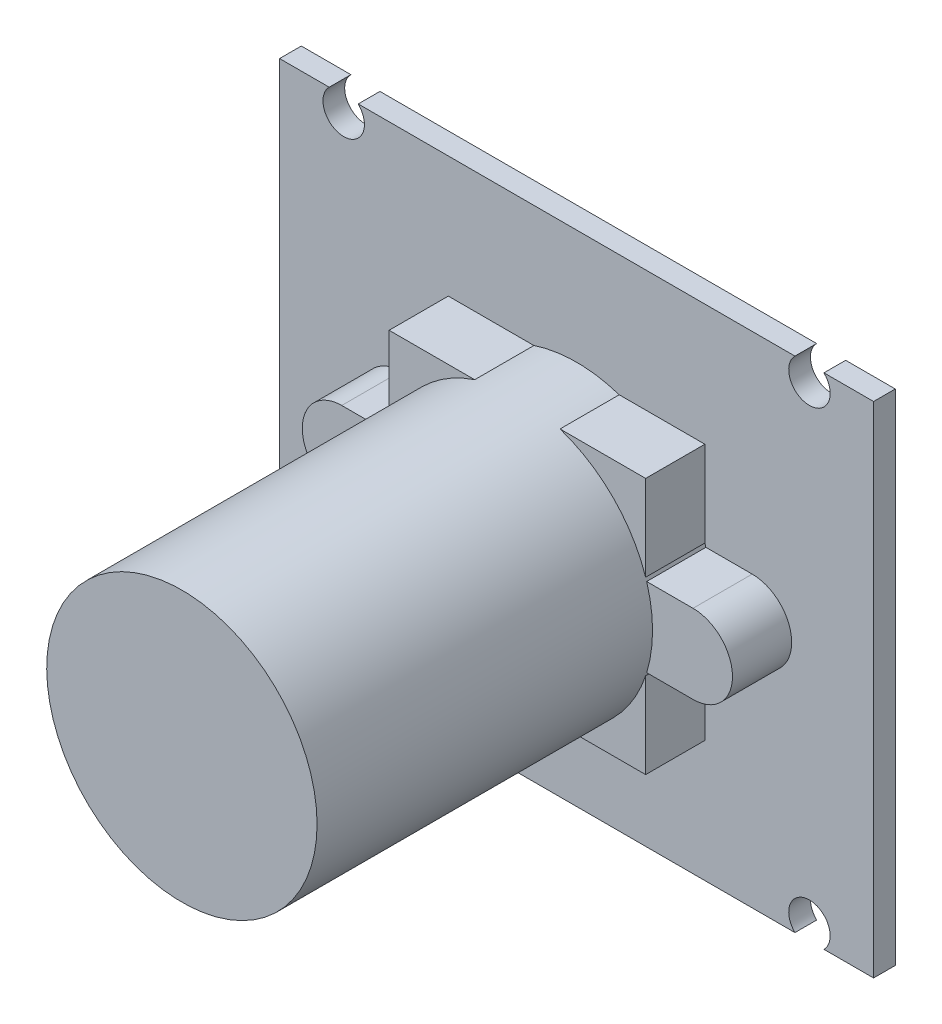
ISO-10303-21;
HEADER;
FILE_DESCRIPTION(('STEP AP214'),'2;1');
FILE_NAME('part.step','',(''),(''),'','','');
FILE_SCHEMA(('AUTOMOTIVE_DESIGN { 1 0 10303 214 1 1 1 1 }'));
ENDSEC;
DATA;
#1=APPLICATION_CONTEXT('core data for automotive mechanical design processes');
#2=APPLICATION_PROTOCOL_DEFINITION('international standard','automotive_design',2000,#1);
#3=PRODUCT_CONTEXT('',#1,'mechanical');
#4=PRODUCT('Part','Part','',(#3));
#5=PRODUCT_RELATED_PRODUCT_CATEGORY('part','',(#4));
#6=PRODUCT_DEFINITION_FORMATION('','',#4);
#7=PRODUCT_DEFINITION_CONTEXT('part definition',#1,'design');
#8=PRODUCT_DEFINITION('design','',#6,#7);
#9=PRODUCT_DEFINITION_SHAPE('','',#8);
#10=(LENGTH_UNIT() NAMED_UNIT(*) SI_UNIT(.MILLI.,.METRE.));
#11=(NAMED_UNIT(*) PLANE_ANGLE_UNIT() SI_UNIT($,.RADIAN.));
#12=(NAMED_UNIT(*) SI_UNIT($,.STERADIAN.) SOLID_ANGLE_UNIT());
#13=UNCERTAINTY_MEASURE_WITH_UNIT(LENGTH_MEASURE(1.E-05),#10,'distance_accuracy_value','');
#14=(GEOMETRIC_REPRESENTATION_CONTEXT(3) GLOBAL_UNCERTAINTY_ASSIGNED_CONTEXT((#13)) GLOBAL_UNIT_ASSIGNED_CONTEXT((#10,
#11,#12)) REPRESENTATION_CONTEXT('',''));
#15=CARTESIAN_POINT('',(0.,0.,0.));
#16=DIRECTION('',(0.,0.,1.));
#17=DIRECTION('',(1.,0.,0.));
#18=AXIS2_PLACEMENT_3D('',#15,#16,#17);
#19=CARTESIAN_POINT('',(0.,0.,1.1));
#20=DIRECTION('',(0.,0.,-1.));
#21=DIRECTION('',(-1.,0.,0.));
#22=AXIS2_PLACEMENT_3D('',#19,#20,#21);
#23=PLANE('',#22);
#24=DIRECTION('',(1.,0.,0.));
#25=VECTOR('',#24,1.);
#26=CARTESIAN_POINT('',(-15.05,-12.65,1.1));
#27=LINE('',#26,#25);
#28=CARTESIAN_POINT('',(-15.05,-12.65,1.1));
#29=VERTEX_POINT('',#28);
#30=CARTESIAN_POINT('',(-12.534846922835,-12.65,1.1));
#31=VERTEX_POINT('',#30);
#32=EDGE_CURVE('E433',#29,#31,#27,.T.);
#33=ORIENTED_EDGE('',*,*,#32,.T.);
#34=CARTESIAN_POINT('',(-11.8,-11.9,1.1));
#35=DIRECTION('',(0.,0.,1.));
#36=DIRECTION('',(1.,0.,0.));
#37=AXIS2_PLACEMENT_3D('',#34,#35,#36);
#38=CIRCLE('',#37,1.05);
#39=CARTESIAN_POINT('',(-11.065153077165,-12.65,1.1));
#40=VERTEX_POINT('',#39);
#41=EDGE_CURVE('E386',#40,#31,#38,.T.);
#42=ORIENTED_EDGE('',*,*,#41,.F.);
#43=CARTESIAN_POINT('',(11.065153077165,-12.65,1.1));
#44=VERTEX_POINT('',#43);
#45=EDGE_CURVE('E437',#40,#44,#27,.T.);
#46=ORIENTED_EDGE('',*,*,#45,.T.);
#47=CARTESIAN_POINT('',(11.8,-11.9,1.1));
#48=DIRECTION('',(0.,0.,1.));
#49=DIRECTION('',(1.,0.,0.));
#50=AXIS2_PLACEMENT_3D('',#47,#48,#49);
#51=CIRCLE('',#50,1.05);
#52=CARTESIAN_POINT('',(12.534846922835,-12.65,1.1));
#53=VERTEX_POINT('',#52);
#54=EDGE_CURVE('E394',#53,#44,#51,.T.);
#55=ORIENTED_EDGE('',*,*,#54,.F.);
#56=CARTESIAN_POINT('',(15.05,-12.65,1.1));
#57=VERTEX_POINT('',#56);
#58=EDGE_CURVE('E432',#53,#57,#27,.T.);
#59=ORIENTED_EDGE('',*,*,#58,.T.);
#60=DIRECTION('',(0.,1.,0.));
#61=VECTOR('',#60,1.);
#62=CARTESIAN_POINT('',(15.05,-12.65,1.1));
#63=LINE('',#62,#61);
#64=CARTESIAN_POINT('',(15.05,12.65,1.1));
#65=VERTEX_POINT('',#64);
#66=EDGE_CURVE('E421',#57,#65,#63,.T.);
#67=ORIENTED_EDGE('',*,*,#66,.T.);
#68=DIRECTION('',(-1.,0.,0.));
#69=VECTOR('',#68,1.);
#70=CARTESIAN_POINT('',(-15.05,12.65,1.1));
#71=LINE('',#70,#69);
#72=CARTESIAN_POINT('',(12.534846922835,12.65,1.1));
#73=VERTEX_POINT('',#72);
#74=EDGE_CURVE('E426',#65,#73,#71,.T.);
#75=ORIENTED_EDGE('',*,*,#74,.T.);
#76=CARTESIAN_POINT('',(11.8,11.9,1.1));
#77=DIRECTION('',(0.,0.,1.));
#78=DIRECTION('',(1.,0.,0.));
#79=AXIS2_PLACEMENT_3D('',#76,#77,#78);
#80=CIRCLE('',#79,1.05);
#81=CARTESIAN_POINT('',(11.065153077165,12.65,1.1));
#82=VERTEX_POINT('',#81);
#83=EDGE_CURVE('E403',#82,#73,#80,.T.);
#84=ORIENTED_EDGE('',*,*,#83,.F.);
#85=CARTESIAN_POINT('',(-11.065153077165,12.65,1.1));
#86=VERTEX_POINT('',#85);
#87=EDGE_CURVE('E430',#82,#86,#71,.T.);
#88=ORIENTED_EDGE('',*,*,#87,.T.);
#89=CARTESIAN_POINT('',(-11.8,11.9,1.1));
#90=DIRECTION('',(0.,0.,1.));
#91=DIRECTION('',(1.,0.,0.));
#92=AXIS2_PLACEMENT_3D('',#89,#90,#91);
#93=CIRCLE('',#92,1.05);
#94=CARTESIAN_POINT('',(-12.534846922835,12.65,1.1));
#95=VERTEX_POINT('',#94);
#96=EDGE_CURVE('E411',#95,#86,#93,.T.);
#97=ORIENTED_EDGE('',*,*,#96,.F.);
#98=CARTESIAN_POINT('',(-15.05,12.65,1.1));
#99=VERTEX_POINT('',#98);
#100=EDGE_CURVE('E424',#95,#99,#71,.T.);
#101=ORIENTED_EDGE('',*,*,#100,.T.);
#102=DIRECTION('',(0.,-1.,0.));
#103=VECTOR('',#102,1.);
#104=CARTESIAN_POINT('',(-15.05,-12.65,1.1));
#105=LINE('',#104,#103);
#106=EDGE_CURVE('E429',#99,#29,#105,.T.);
#107=ORIENTED_EDGE('',*,*,#106,.T.);
#108=EDGE_LOOP('',(#33,#42,#46,#55,#59,#67,#75,#84,#88,#97,#101,#107));
#109=FACE_BOUND('',#108,.T.);
#110=CARTESIAN_POINT('',(0.,0.,1.1));
#111=DIRECTION('',(0.,0.,1.));
#112=DIRECTION('',(1.,0.,0.));
#113=AXIS2_PLACEMENT_3D('',#110,#111,#112);
#114=CIRCLE('',#113,6.85);
#115=CARTESIAN_POINT('',(-6.55152653966997,-2.,1.1));
#116=VERTEX_POINT('',#115);
#117=CARTESIAN_POINT('',(-6.5,-2.16159663212173,1.1));
#118=VERTEX_POINT('',#117);
#119=EDGE_CURVE('E841',#116,#118,#114,.T.);
#120=ORIENTED_EDGE('',*,*,#119,.F.);
#121=DIRECTION('',(1.,0.,0.));
#122=VECTOR('',#121,1.);
#123=CARTESIAN_POINT('',(-8.9,-2.,1.1));
#124=LINE('',#123,#122);
#125=CARTESIAN_POINT('',(-8.9,-2.,1.1));
#126=VERTEX_POINT('',#125);
#127=EDGE_CURVE('E331',#126,#116,#124,.T.);
#128=ORIENTED_EDGE('',*,*,#127,.F.);
#129=CARTESIAN_POINT('',(-8.9,0.,1.1));
#130=DIRECTION('',(0.,0.,1.));
#131=DIRECTION('',(1.,0.,0.));
#132=AXIS2_PLACEMENT_3D('',#129,#130,#131);
#133=CIRCLE('',#132,2.);
#134=CARTESIAN_POINT('',(-8.9,2.,1.1));
#135=VERTEX_POINT('',#134);
#136=EDGE_CURVE('E315',#135,#126,#133,.T.);
#137=ORIENTED_EDGE('',*,*,#136,.F.);
#138=DIRECTION('',(-1.,0.,0.));
#139=VECTOR('',#138,1.);
#140=CARTESIAN_POINT('',(-8.9,2.,1.1));
#141=LINE('',#140,#139);
#142=CARTESIAN_POINT('',(-6.55152653966997,2.,1.1));
#143=VERTEX_POINT('',#142);
#144=EDGE_CURVE('E254',#143,#135,#141,.T.);
#145=ORIENTED_EDGE('',*,*,#144,.F.);
#146=CARTESIAN_POINT('',(-6.5,2.16159663212172,1.1));
#147=VERTEX_POINT('',#146);
#148=EDGE_CURVE('E842',#147,#143,#114,.T.);
#149=ORIENTED_EDGE('',*,*,#148,.F.);
#150=DIRECTION('',(0.,-1.,0.));
#151=VECTOR('',#150,1.);
#152=CARTESIAN_POINT('',(-6.5,-6.5,1.1));
#153=LINE('',#152,#151);
#154=CARTESIAN_POINT('',(-6.5,6.5,1.1));
#155=VERTEX_POINT('',#154);
#156=EDGE_CURVE('E368',#155,#147,#153,.T.);
#157=ORIENTED_EDGE('',*,*,#156,.F.);
#158=DIRECTION('',(-1.,0.,0.));
#159=VECTOR('',#158,1.);
#160=CARTESIAN_POINT('',(-6.5,6.5,1.1));
#161=LINE('',#160,#159);
#162=CARTESIAN_POINT('',(-2.16159663212173,6.5,1.1));
#163=VERTEX_POINT('',#162);
#164=EDGE_CURVE('E363',#163,#155,#161,.T.);
#165=ORIENTED_EDGE('',*,*,#164,.F.);
#166=CARTESIAN_POINT('',(2.16159663212173,6.5,1.1));
#167=VERTEX_POINT('',#166);
#168=EDGE_CURVE('E262',#167,#163,#114,.T.);
#169=ORIENTED_EDGE('',*,*,#168,.F.);
#170=CARTESIAN_POINT('',(6.5,6.5,1.1));
#171=VERTEX_POINT('',#170);
#172=EDGE_CURVE('E364',#171,#167,#161,.T.);
#173=ORIENTED_EDGE('',*,*,#172,.F.);
#174=DIRECTION('',(0.,1.,0.));
#175=VECTOR('',#174,1.);
#176=CARTESIAN_POINT('',(6.5,-6.5,1.1));
#177=LINE('',#176,#175);
#178=CARTESIAN_POINT('',(6.5,2.16159663212172,1.1));
#179=VERTEX_POINT('',#178);
#180=EDGE_CURVE('E259',#179,#171,#177,.T.);
#181=ORIENTED_EDGE('',*,*,#180,.F.);
#182=CARTESIAN_POINT('',(6.55152653966997,2.,1.1));
#183=VERTEX_POINT('',#182);
#184=EDGE_CURVE('E257',#183,#179,#114,.T.);
#185=ORIENTED_EDGE('',*,*,#184,.F.);
#186=CARTESIAN_POINT('',(8.9,2.,1.1));
#187=VERTEX_POINT('',#186);
#188=EDGE_CURVE('E245',#187,#183,#141,.T.);
#189=ORIENTED_EDGE('',*,*,#188,.F.);
#190=CARTESIAN_POINT('',(8.9,0.,1.1));
#191=DIRECTION('',(0.,0.,1.));
#192=DIRECTION('',(1.,0.,0.));
#193=AXIS2_PLACEMENT_3D('',#190,#191,#192);
#194=CIRCLE('',#193,2.);
#195=CARTESIAN_POINT('',(8.9,-2.,1.1));
#196=VERTEX_POINT('',#195);
#197=EDGE_CURVE('E334',#196,#187,#194,.T.);
#198=ORIENTED_EDGE('',*,*,#197,.F.);
#199=CARTESIAN_POINT('',(6.55152653966997,-2.,1.1));
#200=VERTEX_POINT('',#199);
#201=EDGE_CURVE('E330',#200,#196,#124,.T.);
#202=ORIENTED_EDGE('',*,*,#201,.F.);
#203=CARTESIAN_POINT('',(6.5,-2.16159663212173,1.1));
#204=VERTEX_POINT('',#203);
#205=EDGE_CURVE('E48',#204,#200,#114,.T.);
#206=ORIENTED_EDGE('',*,*,#205,.F.);
#207=CARTESIAN_POINT('',(6.5,-6.5,1.1));
#208=VERTEX_POINT('',#207);
#209=EDGE_CURVE('E361',#208,#204,#177,.T.);
#210=ORIENTED_EDGE('',*,*,#209,.F.);
#211=DIRECTION('',(1.,0.,0.));
#212=VECTOR('',#211,1.);
#213=CARTESIAN_POINT('',(-6.5,-6.5,1.1));
#214=LINE('',#213,#212);
#215=CARTESIAN_POINT('',(2.16159663212172,-6.5,1.1));
#216=VERTEX_POINT('',#215);
#217=EDGE_CURVE('E371',#216,#208,#214,.T.);
#218=ORIENTED_EDGE('',*,*,#217,.F.);
#219=CARTESIAN_POINT('',(-2.16159663212173,-6.5,1.1));
#220=VERTEX_POINT('',#219);
#221=EDGE_CURVE('E839',#220,#216,#114,.T.);
#222=ORIENTED_EDGE('',*,*,#221,.F.);
#223=CARTESIAN_POINT('',(-6.5,-6.5,1.1));
#224=VERTEX_POINT('',#223);
#225=EDGE_CURVE('E372',#224,#220,#214,.T.);
#226=ORIENTED_EDGE('',*,*,#225,.F.);
#227=EDGE_CURVE('E367',#118,#224,#153,.T.);
#228=ORIENTED_EDGE('',*,*,#227,.F.);
#229=EDGE_LOOP('',(#120,#128,#137,#145,#149,#157,#165,#169,#173,#181,#185,#189,#198,#202,#206,
#210,#218,#222,#226,#228));
#230=FACE_BOUND('',#229,.T.);
#231=ADVANCED_FACE('F33',(#109,#230),#23,.F.);
#232=CARTESIAN_POINT('',(6.5,-6.5,4.1));
#233=DIRECTION('',(-1.,0.,0.));
#234=DIRECTION('',(0.,0.,1.));
#235=AXIS2_PLACEMENT_3D('',#232,#233,#234);
#236=PLANE('',#235);
#237=DIRECTION('',(0.,0.,-1.));
#238=VECTOR('',#237,1.);
#239=CARTESIAN_POINT('',(6.5,-2.16159663212173,21.1));
#240=LINE('',#239,#238);
#241=CARTESIAN_POINT('',(6.5,-2.16159663212173,4.1));
#242=VERTEX_POINT('',#241);
#243=EDGE_CURVE('E281',#242,#204,#240,.T.);
#244=ORIENTED_EDGE('',*,*,#243,.F.);
#245=DIRECTION('',(0.,1.,0.));
#246=VECTOR('',#245,1.);
#247=CARTESIAN_POINT('',(6.5,-6.5,4.1));
#248=LINE('',#247,#246);
#249=CARTESIAN_POINT('',(6.5,-6.5,4.1));
#250=VERTEX_POINT('',#249);
#251=EDGE_CURVE('E344',#250,#242,#248,.T.);
#252=ORIENTED_EDGE('',*,*,#251,.F.);
#253=DIRECTION('',(0.,0.,-1.));
#254=VECTOR('',#253,1.);
#255=CARTESIAN_POINT('',(6.5,-6.5,4.1));
#256=LINE('',#255,#254);
#257=EDGE_CURVE('E360',#250,#208,#256,.T.);
#258=ORIENTED_EDGE('',*,*,#257,.T.);
#259=ORIENTED_EDGE('',*,*,#209,.T.);
#260=EDGE_LOOP('',(#244,#252,#258,#259));
#261=FACE_BOUND('',#260,.T.);
#262=ADVANCED_FACE('F511',(#261),#236,.F.);
#263=DIRECTION('',(0.,0.,-1.));
#264=VECTOR('',#263,1.);
#265=CARTESIAN_POINT('',(6.5,2.16159663212173,21.1));
#266=LINE('',#265,#264);
#267=CARTESIAN_POINT('',(6.5,2.16159663212173,4.1));
#268=VERTEX_POINT('',#267);
#269=EDGE_CURVE('E56',#179,#268,#266,.F.);
#270=ORIENTED_EDGE('',*,*,#269,.F.);
#271=ORIENTED_EDGE('',*,*,#180,.T.);
#272=DIRECTION('',(0.,0.,-1.));
#273=VECTOR('',#272,1.);
#274=CARTESIAN_POINT('',(6.5,6.5,4.1));
#275=LINE('',#274,#273);
#276=CARTESIAN_POINT('',(6.5,6.5,4.1));
#277=VERTEX_POINT('',#276);
#278=EDGE_CURVE('E383',#277,#171,#275,.T.);
#279=ORIENTED_EDGE('',*,*,#278,.F.);
#280=EDGE_CURVE('E348',#268,#277,#248,.T.);
#281=ORIENTED_EDGE('',*,*,#280,.F.);
#282=EDGE_LOOP('',(#270,#271,#279,#281));
#283=FACE_BOUND('',#282,.T.);
#284=ADVANCED_FACE('F516',(#283),#236,.F.);
#285=CARTESIAN_POINT('',(-6.5,-6.5,4.1));
#286=DIRECTION('',(1.,0.,0.));
#287=DIRECTION('',(0.,0.,-1.));
#288=AXIS2_PLACEMENT_3D('',#285,#286,#287);
#289=PLANE('',#288);
#290=DIRECTION('',(0.,0.,-1.));
#291=VECTOR('',#290,1.);
#292=CARTESIAN_POINT('',(-6.5,-2.16159663212173,21.1));
#293=LINE('',#292,#291);
#294=CARTESIAN_POINT('',(-6.5,-2.16159663212173,4.1));
#295=VERTEX_POINT('',#294);
#296=EDGE_CURVE('E312',#118,#295,#293,.F.);
#297=ORIENTED_EDGE('',*,*,#296,.F.);
#298=ORIENTED_EDGE('',*,*,#227,.T.);
#299=DIRECTION('',(0.,0.,-1.));
#300=VECTOR('',#299,1.);
#301=CARTESIAN_POINT('',(-6.5,-6.5,4.1));
#302=LINE('',#301,#300);
#303=CARTESIAN_POINT('',(-6.5,-6.5,4.1));
#304=VERTEX_POINT('',#303);
#305=EDGE_CURVE('E377',#304,#224,#302,.T.);
#306=ORIENTED_EDGE('',*,*,#305,.F.);
#307=DIRECTION('',(0.,-1.,0.));
#308=VECTOR('',#307,1.);
#309=CARTESIAN_POINT('',(-6.5,-6.5,4.1));
#310=LINE('',#309,#308);
#311=EDGE_CURVE('E352',#295,#304,#310,.T.);
#312=ORIENTED_EDGE('',*,*,#311,.F.);
#313=EDGE_LOOP('',(#297,#298,#306,#312));
#314=FACE_BOUND('',#313,.T.);
#315=ADVANCED_FACE('F614',(#314),#289,.F.);
#316=DIRECTION('',(0.,0.,-1.));
#317=VECTOR('',#316,1.);
#318=CARTESIAN_POINT('',(-6.5,2.16159663212173,21.1));
#319=LINE('',#318,#317);
#320=CARTESIAN_POINT('',(-6.5,2.16159663212173,4.1));
#321=VERTEX_POINT('',#320);
#322=EDGE_CURVE('E295',#321,#147,#319,.T.);
#323=ORIENTED_EDGE('',*,*,#322,.F.);
#324=CARTESIAN_POINT('',(-6.5,6.5,4.1));
#325=VERTEX_POINT('',#324);
#326=EDGE_CURVE('E353',#325,#321,#310,.T.);
#327=ORIENTED_EDGE('',*,*,#326,.F.);
#328=DIRECTION('',(0.,0.,-1.));
#329=VECTOR('',#328,1.);
#330=CARTESIAN_POINT('',(-6.5,6.5,4.1));
#331=LINE('',#330,#329);
#332=EDGE_CURVE('E380',#325,#155,#331,.T.);
#333=ORIENTED_EDGE('',*,*,#332,.T.);
#334=ORIENTED_EDGE('',*,*,#156,.T.);
#335=EDGE_LOOP('',(#323,#327,#333,#334));
#336=FACE_BOUND('',#335,.T.);
#337=ADVANCED_FACE('F622',(#336),#289,.F.);
#338=CARTESIAN_POINT('',(-6.5,6.5,4.1));
#339=DIRECTION('',(0.,-1.,0.));
#340=DIRECTION('',(0.,0.,-1.));
#341=AXIS2_PLACEMENT_3D('',#338,#339,#340);
#342=PLANE('',#341);
#343=DIRECTION('',(0.,0.,-1.));
#344=VECTOR('',#343,1.);
#345=CARTESIAN_POINT('',(-2.16159663212173,6.5,21.1));
#346=LINE('',#345,#344);
#347=CARTESIAN_POINT('',(-2.16159663212173,6.5,4.1));
#348=VERTEX_POINT('',#347);
#349=EDGE_CURVE('E291',#163,#348,#346,.F.);
#350=ORIENTED_EDGE('',*,*,#349,.F.);
#351=ORIENTED_EDGE('',*,*,#164,.T.);
#352=ORIENTED_EDGE('',*,*,#332,.F.);
#353=DIRECTION('',(-1.,0.,0.));
#354=VECTOR('',#353,1.);
#355=CARTESIAN_POINT('',(-6.5,6.5,4.1));
#356=LINE('',#355,#354);
#357=EDGE_CURVE('E347',#348,#325,#356,.T.);
#358=ORIENTED_EDGE('',*,*,#357,.F.);
#359=EDGE_LOOP('',(#350,#351,#352,#358));
#360=FACE_BOUND('',#359,.T.);
#361=ADVANCED_FACE('F632',(#360),#342,.F.);
#362=DIRECTION('',(0.,0.,-1.));
#363=VECTOR('',#362,1.);
#364=CARTESIAN_POINT('',(2.16159663212173,6.5,21.1));
#365=LINE('',#364,#363);
#366=CARTESIAN_POINT('',(2.16159663212173,6.5,4.1));
#367=VERTEX_POINT('',#366);
#368=EDGE_CURVE('E298',#367,#167,#365,.T.);
#369=ORIENTED_EDGE('',*,*,#368,.F.);
#370=EDGE_CURVE('E349',#277,#367,#356,.T.);
#371=ORIENTED_EDGE('',*,*,#370,.F.);
#372=ORIENTED_EDGE('',*,*,#278,.T.);
#373=ORIENTED_EDGE('',*,*,#172,.T.);
#374=EDGE_LOOP('',(#369,#371,#372,#373));
#375=FACE_BOUND('',#374,.T.);
#376=ADVANCED_FACE('F641',(#375),#342,.F.);
#377=CARTESIAN_POINT('',(-6.5,-6.5,4.1));
#378=DIRECTION('',(0.,1.,0.));
#379=DIRECTION('',(0.,0.,1.));
#380=AXIS2_PLACEMENT_3D('',#377,#378,#379);
#381=PLANE('',#380);
#382=DIRECTION('',(0.,0.,-1.));
#383=VECTOR('',#382,1.);
#384=CARTESIAN_POINT('',(2.16159663212172,-6.5,21.1));
#385=LINE('',#384,#383);
#386=CARTESIAN_POINT('',(2.16159663212173,-6.5,4.1));
#387=VERTEX_POINT('',#386);
#388=EDGE_CURVE('E303',#216,#387,#385,.F.);
#389=ORIENTED_EDGE('',*,*,#388,.F.);
#390=ORIENTED_EDGE('',*,*,#217,.T.);
#391=ORIENTED_EDGE('',*,*,#257,.F.);
#392=DIRECTION('',(1.,0.,0.));
#393=VECTOR('',#392,1.);
#394=CARTESIAN_POINT('',(-6.5,-6.5,4.1));
#395=LINE('',#394,#393);
#396=EDGE_CURVE('E356',#387,#250,#395,.T.);
#397=ORIENTED_EDGE('',*,*,#396,.F.);
#398=EDGE_LOOP('',(#389,#390,#391,#397));
#399=FACE_BOUND('',#398,.T.);
#400=ADVANCED_FACE('F651',(#399),#381,.F.);
#401=DIRECTION('',(0.,0.,-1.));
#402=VECTOR('',#401,1.);
#403=CARTESIAN_POINT('',(-2.16159663212172,-6.5,21.1));
#404=LINE('',#403,#402);
#405=CARTESIAN_POINT('',(-2.16159663212173,-6.5,4.1));
#406=VERTEX_POINT('',#405);
#407=EDGE_CURVE('E280',#406,#220,#404,.T.);
#408=ORIENTED_EDGE('',*,*,#407,.F.);
#409=EDGE_CURVE('E357',#304,#406,#395,.T.);
#410=ORIENTED_EDGE('',*,*,#409,.F.);
#411=ORIENTED_EDGE('',*,*,#305,.T.);
#412=ORIENTED_EDGE('',*,*,#225,.T.);
#413=EDGE_LOOP('',(#408,#410,#411,#412));
#414=FACE_BOUND('',#413,.T.);
#415=ADVANCED_FACE('F660',(#414),#381,.F.);
#416=CARTESIAN_POINT('',(0.,0.,4.1));
#417=DIRECTION('',(0.,0.,-1.));
#418=DIRECTION('',(-1.,0.,0.));
#419=AXIS2_PLACEMENT_3D('',#416,#417,#418);
#420=PLANE('',#419);
#421=CARTESIAN_POINT('',(0.,0.,4.1));
#422=DIRECTION('',(0.,0.,-1.));
#423=DIRECTION('',(-1.,0.,0.));
#424=AXIS2_PLACEMENT_3D('',#421,#422,#423);
#425=CIRCLE('',#424,6.85);
#426=EDGE_CURVE('E273',#295,#406,#425,.F.);
#427=ORIENTED_EDGE('',*,*,#426,.F.);
#428=ORIENTED_EDGE('',*,*,#311,.T.);
#429=ORIENTED_EDGE('',*,*,#409,.T.);
#430=EDGE_LOOP('',(#427,#428,#429));
#431=FACE_BOUND('',#430,.T.);
#432=ADVANCED_FACE('F670',(#431),#420,.F.);
#433=EDGE_CURVE('E282',#387,#242,#425,.F.);
#434=ORIENTED_EDGE('',*,*,#433,.F.);
#435=ORIENTED_EDGE('',*,*,#396,.T.);
#436=ORIENTED_EDGE('',*,*,#251,.T.);
#437=EDGE_LOOP('',(#434,#435,#436));
#438=FACE_BOUND('',#437,.T.);
#439=ADVANCED_FACE('F679',(#438),#420,.F.);
#440=CARTESIAN_POINT('',(6.55152653966997,-2.,4.1));
#441=VERTEX_POINT('',#440);
#442=CARTESIAN_POINT('',(6.55152653966997,2.,4.1));
#443=VERTEX_POINT('',#442);
#444=EDGE_CURVE('E268',#441,#443,#425,.F.);
#445=ORIENTED_EDGE('',*,*,#444,.F.);
#446=DIRECTION('',(1.,0.,0.));
#447=VECTOR('',#446,1.);
#448=CARTESIAN_POINT('',(-8.9,-2.,4.1));
#449=LINE('',#448,#447);
#450=CARTESIAN_POINT('',(8.9,-2.,4.1));
#451=VERTEX_POINT('',#450);
#452=EDGE_CURVE('E318',#441,#451,#449,.T.);
#453=ORIENTED_EDGE('',*,*,#452,.T.);
#454=CARTESIAN_POINT('',(8.9,0.,4.1));
#455=DIRECTION('',(0.,0.,1.));
#456=DIRECTION('',(1.,0.,0.));
#457=AXIS2_PLACEMENT_3D('',#454,#455,#456);
#458=CIRCLE('',#457,2.);
#459=CARTESIAN_POINT('',(8.9,2.,4.1));
#460=VERTEX_POINT('',#459);
#461=EDGE_CURVE('E322',#451,#460,#458,.T.);
#462=ORIENTED_EDGE('',*,*,#461,.T.);
#463=DIRECTION('',(-1.,0.,0.));
#464=VECTOR('',#463,1.);
#465=CARTESIAN_POINT('',(-8.9,2.,4.1));
#466=LINE('',#465,#464);
#467=EDGE_CURVE('E325',#460,#443,#466,.T.);
#468=ORIENTED_EDGE('',*,*,#467,.T.);
#469=EDGE_LOOP('',(#445,#453,#462,#468));
#470=FACE_BOUND('',#469,.T.);
#471=ADVANCED_FACE('F691',(#470),#420,.F.);
#472=EDGE_CURVE('E292',#268,#367,#425,.F.);
#473=ORIENTED_EDGE('',*,*,#472,.F.);
#474=ORIENTED_EDGE('',*,*,#280,.T.);
#475=ORIENTED_EDGE('',*,*,#370,.T.);
#476=EDGE_LOOP('',(#473,#474,#475));
#477=FACE_BOUND('',#476,.T.);
#478=ADVANCED_FACE('F701',(#477),#420,.F.);
#479=EDGE_CURVE('E285',#348,#321,#425,.F.);
#480=ORIENTED_EDGE('',*,*,#479,.F.);
#481=ORIENTED_EDGE('',*,*,#357,.T.);
#482=ORIENTED_EDGE('',*,*,#326,.T.);
#483=EDGE_LOOP('',(#480,#481,#482));
#484=FACE_BOUND('',#483,.T.);
#485=ADVANCED_FACE('F710',(#484),#420,.F.);
#486=CARTESIAN_POINT('',(-6.55152653966997,2.,4.1));
#487=VERTEX_POINT('',#486);
#488=CARTESIAN_POINT('',(-6.55152653966997,-2.,4.1));
#489=VERTEX_POINT('',#488);
#490=EDGE_CURVE('E274',#487,#489,#425,.F.);
#491=ORIENTED_EDGE('',*,*,#490,.F.);
#492=CARTESIAN_POINT('',(-8.9,2.,4.1));
#493=VERTEX_POINT('',#492);
#494=EDGE_CURVE('E324',#487,#493,#466,.T.);
#495=ORIENTED_EDGE('',*,*,#494,.T.);
#496=CARTESIAN_POINT('',(-8.9,0.,4.1));
#497=DIRECTION('',(0.,0.,1.));
#498=DIRECTION('',(1.,0.,0.));
#499=AXIS2_PLACEMENT_3D('',#496,#497,#498);
#500=CIRCLE('',#499,2.);
#501=CARTESIAN_POINT('',(-8.9,-2.,4.1));
#502=VERTEX_POINT('',#501);
#503=EDGE_CURVE('E253',#493,#502,#500,.T.);
#504=ORIENTED_EDGE('',*,*,#503,.T.);
#505=EDGE_CURVE('E319',#502,#489,#449,.T.);
#506=ORIENTED_EDGE('',*,*,#505,.T.);
#507=EDGE_LOOP('',(#491,#495,#504,#506));
#508=FACE_BOUND('',#507,.T.);
#509=ADVANCED_FACE('F682',(#508),#420,.F.);
#510=CARTESIAN_POINT('',(-8.9,2.,4.1));
#511=DIRECTION('',(0.,-1.,0.));
#512=DIRECTION('',(1.,0.,0.));
#513=AXIS2_PLACEMENT_3D('',#510,#511,#512);
#514=PLANE('',#513);
#515=DIRECTION('',(0.,0.,-1.));
#516=VECTOR('',#515,1.);
#517=CARTESIAN_POINT('',(-6.55152653966997,2.,21.1));
#518=LINE('',#517,#516);
#519=EDGE_CURVE('E284',#143,#487,#518,.F.);
#520=ORIENTED_EDGE('',*,*,#519,.F.);
#521=ORIENTED_EDGE('',*,*,#144,.T.);
#522=DIRECTION('',(0.,0.,-1.));
#523=VECTOR('',#522,1.);
#524=CARTESIAN_POINT('',(-8.9,2.,4.1));
#525=LINE('',#524,#523);
#526=EDGE_CURVE('E327',#493,#135,#525,.T.);
#527=ORIENTED_EDGE('',*,*,#526,.F.);
#528=ORIENTED_EDGE('',*,*,#494,.F.);
#529=EDGE_LOOP('',(#520,#521,#527,#528));
#530=FACE_BOUND('',#529,.T.);
#531=ADVANCED_FACE('F729',(#530),#514,.F.);
#532=CARTESIAN_POINT('',(-8.9,-2.,4.1));
#533=DIRECTION('',(0.,1.,0.));
#534=DIRECTION('',(0.,0.,1.));
#535=AXIS2_PLACEMENT_3D('',#532,#533,#534);
#536=PLANE('',#535);
#537=DIRECTION('',(0.,0.,-1.));
#538=VECTOR('',#537,1.);
#539=CARTESIAN_POINT('',(-6.55152653966997,-2.,21.1));
#540=LINE('',#539,#538);
#541=EDGE_CURVE('E275',#489,#116,#540,.T.);
#542=ORIENTED_EDGE('',*,*,#541,.F.);
#543=ORIENTED_EDGE('',*,*,#505,.F.);
#544=DIRECTION('',(0.,0.,-1.));
#545=VECTOR('',#544,1.);
#546=CARTESIAN_POINT('',(-8.9,-2.,4.1));
#547=LINE('',#546,#545);
#548=EDGE_CURVE('E342',#502,#126,#547,.T.);
#549=ORIENTED_EDGE('',*,*,#548,.T.);
#550=ORIENTED_EDGE('',*,*,#127,.T.);
#551=EDGE_LOOP('',(#542,#543,#549,#550));
#552=FACE_BOUND('',#551,.T.);
#553=ADVANCED_FACE('F739',(#552),#536,.F.);
#554=DIRECTION('',(0.,0.,-1.));
#555=VECTOR('',#554,1.);
#556=CARTESIAN_POINT('',(6.55152653966997,-2.,21.1));
#557=LINE('',#556,#555);
#558=EDGE_CURVE('E269',#200,#441,#557,.F.);
#559=ORIENTED_EDGE('',*,*,#558,.F.);
#560=ORIENTED_EDGE('',*,*,#201,.T.);
#561=DIRECTION('',(0.,0.,-1.));
#562=VECTOR('',#561,1.);
#563=CARTESIAN_POINT('',(8.9,-2.,4.1));
#564=LINE('',#563,#562);
#565=EDGE_CURVE('E339',#451,#196,#564,.T.);
#566=ORIENTED_EDGE('',*,*,#565,.F.);
#567=ORIENTED_EDGE('',*,*,#452,.F.);
#568=EDGE_LOOP('',(#559,#560,#566,#567));
#569=FACE_BOUND('',#568,.T.);
#570=ADVANCED_FACE('F749',(#569),#536,.F.);
#571=DIRECTION('',(0.,0.,-1.));
#572=VECTOR('',#571,1.);
#573=CARTESIAN_POINT('',(6.55152653966997,2.,21.1));
#574=LINE('',#573,#572);
#575=EDGE_CURVE('E11',#443,#183,#574,.T.);
#576=ORIENTED_EDGE('',*,*,#575,.F.);
#577=ORIENTED_EDGE('',*,*,#467,.F.);
#578=DIRECTION('',(0.,0.,-1.));
#579=VECTOR('',#578,1.);
#580=CARTESIAN_POINT('',(8.9,2.,4.1));
#581=LINE('',#580,#579);
#582=EDGE_CURVE('E251',#460,#187,#581,.T.);
#583=ORIENTED_EDGE('',*,*,#582,.T.);
#584=ORIENTED_EDGE('',*,*,#188,.T.);
#585=EDGE_LOOP('',(#576,#577,#583,#584));
#586=FACE_BOUND('',#585,.T.);
#587=ADVANCED_FACE('F247',(#586),#514,.F.);
#588=CARTESIAN_POINT('',(-15.05,-12.65,1.1));
#589=DIRECTION('',(0.,1.,0.));
#590=DIRECTION('',(0.,0.,1.));
#591=AXIS2_PLACEMENT_3D('',#588,#589,#590);
#592=PLANE('',#591);
#593=DIRECTION('',(1.,0.,0.));
#594=VECTOR('',#593,1.);
#595=CARTESIAN_POINT('',(-15.05,-12.65,0.));
#596=LINE('',#595,#594);
#597=CARTESIAN_POINT('',(-15.05,-12.65,0.));
#598=VERTEX_POINT('',#597);
#599=CARTESIAN_POINT('',(-12.534846922835,-12.65,0.));
#600=VERTEX_POINT('',#599);
#601=EDGE_CURVE('E425',#598,#600,#596,.T.);
#602=ORIENTED_EDGE('',*,*,#601,.T.);
#603=DIRECTION('',(0.,0.,1.));
#604=VECTOR('',#603,1.);
#605=CARTESIAN_POINT('',(-12.534846922835,-12.65,0.));
#606=LINE('',#605,#604);
#607=EDGE_CURVE('E391',#600,#31,#606,.T.);
#608=ORIENTED_EDGE('',*,*,#607,.T.);
#609=ORIENTED_EDGE('',*,*,#32,.F.);
#610=DIRECTION('',(0.,0.,-1.));
#611=VECTOR('',#610,1.);
#612=CARTESIAN_POINT('',(-15.05,-12.65,1.1));
#613=LINE('',#612,#611);
#614=EDGE_CURVE('E453',#29,#598,#613,.T.);
#615=ORIENTED_EDGE('',*,*,#614,.T.);
#616=EDGE_LOOP('',(#602,#608,#609,#615));
#617=FACE_BOUND('',#616,.T.);
#618=ADVANCED_FACE('F526',(#617),#592,.F.);
#619=ORIENTED_EDGE('',*,*,#45,.F.);
#620=DIRECTION('',(0.,0.,1.));
#621=VECTOR('',#620,1.);
#622=CARTESIAN_POINT('',(-11.065153077165,-12.65,0.));
#623=LINE('',#622,#621);
#624=CARTESIAN_POINT('',(-11.065153077165,-12.65,0.));
#625=VERTEX_POINT('',#624);
#626=EDGE_CURVE('E388',#40,#625,#623,.F.);
#627=ORIENTED_EDGE('',*,*,#626,.T.);
#628=CARTESIAN_POINT('',(11.065153077165,-12.65,0.));
#629=VERTEX_POINT('',#628);
#630=EDGE_CURVE('E450',#625,#629,#596,.T.);
#631=ORIENTED_EDGE('',*,*,#630,.T.);
#632=DIRECTION('',(0.,0.,1.));
#633=VECTOR('',#632,1.);
#634=CARTESIAN_POINT('',(11.065153077165,-12.65,0.));
#635=LINE('',#634,#633);
#636=EDGE_CURVE('E400',#629,#44,#635,.T.);
#637=ORIENTED_EDGE('',*,*,#636,.T.);
#638=EDGE_LOOP('',(#619,#627,#631,#637));
#639=FACE_BOUND('',#638,.T.);
#640=ADVANCED_FACE('F476',(#639),#592,.F.);
#641=CARTESIAN_POINT('',(-15.05,12.65,1.1));
#642=DIRECTION('',(0.,-1.,0.));
#643=DIRECTION('',(0.,0.,-1.));
#644=AXIS2_PLACEMENT_3D('',#641,#642,#643);
#645=PLANE('',#644);
#646=DIRECTION('',(-1.,0.,0.));
#647=VECTOR('',#646,1.);
#648=CARTESIAN_POINT('',(-15.05,12.65,0.));
#649=LINE('',#648,#647);
#650=CARTESIAN_POINT('',(15.05,12.65,0.));
#651=VERTEX_POINT('',#650);
#652=CARTESIAN_POINT('',(12.534846922835,12.65,0.));
#653=VERTEX_POINT('',#652);
#654=EDGE_CURVE('E441',#651,#653,#649,.T.);
#655=ORIENTED_EDGE('',*,*,#654,.T.);
#656=DIRECTION('',(0.,0.,1.));
#657=VECTOR('',#656,1.);
#658=CARTESIAN_POINT('',(12.534846922835,12.65,0.));
#659=LINE('',#658,#657);
#660=EDGE_CURVE('E408',#653,#73,#659,.T.);
#661=ORIENTED_EDGE('',*,*,#660,.T.);
#662=ORIENTED_EDGE('',*,*,#74,.F.);
#663=DIRECTION('',(0.,0.,-1.));
#664=VECTOR('',#663,1.);
#665=CARTESIAN_POINT('',(15.05,12.65,1.1));
#666=LINE('',#665,#664);
#667=EDGE_CURVE('E459',#65,#651,#666,.T.);
#668=ORIENTED_EDGE('',*,*,#667,.T.);
#669=EDGE_LOOP('',(#655,#661,#662,#668));
#670=FACE_BOUND('',#669,.T.);
#671=ADVANCED_FACE('F492',(#670),#645,.F.);
#672=ORIENTED_EDGE('',*,*,#87,.F.);
#673=DIRECTION('',(0.,0.,1.));
#674=VECTOR('',#673,1.);
#675=CARTESIAN_POINT('',(11.065153077165,12.65,0.));
#676=LINE('',#675,#674);
#677=CARTESIAN_POINT('',(11.065153077165,12.65,0.));
#678=VERTEX_POINT('',#677);
#679=EDGE_CURVE('E405',#82,#678,#676,.F.);
#680=ORIENTED_EDGE('',*,*,#679,.T.);
#681=CARTESIAN_POINT('',(-11.065153077165,12.65,0.));
#682=VERTEX_POINT('',#681);
#683=EDGE_CURVE('E445',#678,#682,#649,.T.);
#684=ORIENTED_EDGE('',*,*,#683,.T.);
#685=DIRECTION('',(0.,0.,1.));
#686=VECTOR('',#685,1.);
#687=CARTESIAN_POINT('',(-11.065153077165,12.65,0.));
#688=LINE('',#687,#686);
#689=EDGE_CURVE('E417',#682,#86,#688,.T.);
#690=ORIENTED_EDGE('',*,*,#689,.T.);
#691=EDGE_LOOP('',(#672,#680,#684,#690));
#692=FACE_BOUND('',#691,.T.);
#693=ADVANCED_FACE('F532',(#692),#645,.F.);
#694=CARTESIAN_POINT('',(15.05,-12.65,1.1));
#695=DIRECTION('',(-1.,0.,0.));
#696=DIRECTION('',(0.,0.,1.));
#697=AXIS2_PLACEMENT_3D('',#694,#695,#696);
#698=PLANE('',#697);
#699=DIRECTION('',(0.,1.,0.));
#700=VECTOR('',#699,1.);
#701=CARTESIAN_POINT('',(15.05,-12.65,0.));
#702=LINE('',#701,#700);
#703=CARTESIAN_POINT('',(15.05,-12.65,0.));
#704=VERTEX_POINT('',#703);
#705=EDGE_CURVE('E420',#704,#651,#702,.T.);
#706=ORIENTED_EDGE('',*,*,#705,.T.);
#707=ORIENTED_EDGE('',*,*,#667,.F.);
#708=ORIENTED_EDGE('',*,*,#66,.F.);
#709=DIRECTION('',(0.,0.,-1.));
#710=VECTOR('',#709,1.);
#711=CARTESIAN_POINT('',(15.05,-12.65,1.1));
#712=LINE('',#711,#710);
#713=EDGE_CURVE('E436',#57,#704,#712,.T.);
#714=ORIENTED_EDGE('',*,*,#713,.T.);
#715=EDGE_LOOP('',(#706,#707,#708,#714));
#716=FACE_BOUND('',#715,.T.);
#717=ADVANCED_FACE('F35',(#716),#698,.F.);
#718=ORIENTED_EDGE('',*,*,#100,.F.);
#719=DIRECTION('',(0.,0.,1.));
#720=VECTOR('',#719,1.);
#721=CARTESIAN_POINT('',(-12.534846922835,12.65,0.));
#722=LINE('',#721,#720);
#723=CARTESIAN_POINT('',(-12.534846922835,12.65,0.));
#724=VERTEX_POINT('',#723);
#725=EDGE_CURVE('E414',#95,#724,#722,.F.);
#726=ORIENTED_EDGE('',*,*,#725,.T.);
#727=CARTESIAN_POINT('',(-15.05,12.65,0.));
#728=VERTEX_POINT('',#727);
#729=EDGE_CURVE('E440',#724,#728,#649,.T.);
#730=ORIENTED_EDGE('',*,*,#729,.T.);
#731=DIRECTION('',(0.,0.,-1.));
#732=VECTOR('',#731,1.);
#733=CARTESIAN_POINT('',(-15.05,12.65,1.1));
#734=LINE('',#733,#732);
#735=EDGE_CURVE('E456',#99,#728,#734,.T.);
#736=ORIENTED_EDGE('',*,*,#735,.F.);
#737=EDGE_LOOP('',(#718,#726,#730,#736));
#738=FACE_BOUND('',#737,.T.);
#739=ADVANCED_FACE('F528',(#738),#645,.F.);
#740=CARTESIAN_POINT('',(-15.05,-12.65,1.1));
#741=DIRECTION('',(1.,0.,0.));
#742=DIRECTION('',(0.,0.,-1.));
#743=AXIS2_PLACEMENT_3D('',#740,#741,#742);
#744=PLANE('',#743);
#745=DIRECTION('',(0.,-1.,0.));
#746=VECTOR('',#745,1.);
#747=CARTESIAN_POINT('',(-15.05,-12.65,0.));
#748=LINE('',#747,#746);
#749=EDGE_CURVE('E444',#728,#598,#748,.T.);
#750=ORIENTED_EDGE('',*,*,#749,.T.);
#751=ORIENTED_EDGE('',*,*,#614,.F.);
#752=ORIENTED_EDGE('',*,*,#106,.F.);
#753=ORIENTED_EDGE('',*,*,#735,.T.);
#754=EDGE_LOOP('',(#750,#751,#752,#753));
#755=FACE_BOUND('',#754,.T.);
#756=ADVANCED_FACE('F525',(#755),#744,.F.);
#757=ORIENTED_EDGE('',*,*,#58,.F.);
#758=DIRECTION('',(0.,0.,1.));
#759=VECTOR('',#758,1.);
#760=CARTESIAN_POINT('',(12.534846922835,-12.65,0.));
#761=LINE('',#760,#759);
#762=CARTESIAN_POINT('',(12.534846922835,-12.65,0.));
#763=VERTEX_POINT('',#762);
#764=EDGE_CURVE('E397',#53,#763,#761,.F.);
#765=ORIENTED_EDGE('',*,*,#764,.T.);
#766=EDGE_CURVE('E447',#763,#704,#596,.T.);
#767=ORIENTED_EDGE('',*,*,#766,.T.);
#768=ORIENTED_EDGE('',*,*,#713,.F.);
#769=EDGE_LOOP('',(#757,#765,#767,#768));
#770=FACE_BOUND('',#769,.T.);
#771=ADVANCED_FACE('F484',(#770),#592,.F.);
#772=CARTESIAN_POINT('',(0.,0.,0.));
#773=DIRECTION('',(0.,0.,-1.));
#774=DIRECTION('',(-1.,0.,0.));
#775=AXIS2_PLACEMENT_3D('',#772,#773,#774);
#776=PLANE('',#775);
#777=CARTESIAN_POINT('',(-11.8,-11.9,0.));
#778=DIRECTION('',(0.,0.,-1.));
#779=DIRECTION('',(-1.,0.,0.));
#780=AXIS2_PLACEMENT_3D('',#777,#778,#779);
#781=CIRCLE('',#780,1.05);
#782=EDGE_CURVE('E41',#600,#625,#781,.T.);
#783=ORIENTED_EDGE('',*,*,#782,.F.);
#784=ORIENTED_EDGE('',*,*,#601,.F.);
#785=ORIENTED_EDGE('',*,*,#749,.F.);
#786=ORIENTED_EDGE('',*,*,#729,.F.);
#787=CARTESIAN_POINT('',(-11.8,11.9,0.));
#788=DIRECTION('',(0.,0.,-1.));
#789=DIRECTION('',(-1.,0.,0.));
#790=AXIS2_PLACEMENT_3D('',#787,#788,#789);
#791=CIRCLE('',#790,1.05);
#792=EDGE_CURVE('E462',#682,#724,#791,.T.);
#793=ORIENTED_EDGE('',*,*,#792,.F.);
#794=ORIENTED_EDGE('',*,*,#683,.F.);
#795=CARTESIAN_POINT('',(11.8,11.9,0.));
#796=DIRECTION('',(0.,0.,-1.));
#797=DIRECTION('',(-1.,0.,0.));
#798=AXIS2_PLACEMENT_3D('',#795,#796,#797);
#799=CIRCLE('',#798,1.05);
#800=EDGE_CURVE('E464',#653,#678,#799,.T.);
#801=ORIENTED_EDGE('',*,*,#800,.F.);
#802=ORIENTED_EDGE('',*,*,#654,.F.);
#803=ORIENTED_EDGE('',*,*,#705,.F.);
#804=ORIENTED_EDGE('',*,*,#766,.F.);
#805=CARTESIAN_POINT('',(11.8,-11.9,0.));
#806=DIRECTION('',(0.,0.,-1.));
#807=DIRECTION('',(-1.,0.,0.));
#808=AXIS2_PLACEMENT_3D('',#805,#806,#807);
#809=CIRCLE('',#808,1.05);
#810=EDGE_CURVE('E466',#629,#763,#809,.T.);
#811=ORIENTED_EDGE('',*,*,#810,.F.);
#812=ORIENTED_EDGE('',*,*,#630,.F.);
#813=EDGE_LOOP('',(#783,#784,#785,#786,#793,#794,#801,#802,#803,#804,#811,#812));
#814=FACE_BOUND('',#813,.T.);
#815=ADVANCED_FACE('F479',(#814),#776,.T.);
#816=CARTESIAN_POINT('',(-11.8,11.9,0.));
#817=DIRECTION('',(0.,0.,1.));
#818=DIRECTION('',(1.,0.,0.));
#819=AXIS2_PLACEMENT_3D('',#816,#817,#818);
#820=CYLINDRICAL_SURFACE('',#819,1.05);
#821=ORIENTED_EDGE('',*,*,#792,.T.);
#822=ORIENTED_EDGE('',*,*,#725,.F.);
#823=ORIENTED_EDGE('',*,*,#96,.T.);
#824=ORIENTED_EDGE('',*,*,#689,.F.);
#825=EDGE_LOOP('',(#821,#822,#823,#824));
#826=FACE_BOUND('',#825,.T.);
#827=ADVANCED_FACE('F507',(#826),#820,.F.);
#828=CARTESIAN_POINT('',(11.8,11.9,0.));
#829=DIRECTION('',(0.,0.,1.));
#830=DIRECTION('',(1.,0.,0.));
#831=AXIS2_PLACEMENT_3D('',#828,#829,#830);
#832=CYLINDRICAL_SURFACE('',#831,1.05);
#833=ORIENTED_EDGE('',*,*,#800,.T.);
#834=ORIENTED_EDGE('',*,*,#679,.F.);
#835=ORIENTED_EDGE('',*,*,#83,.T.);
#836=ORIENTED_EDGE('',*,*,#660,.F.);
#837=EDGE_LOOP('',(#833,#834,#835,#836));
#838=FACE_BOUND('',#837,.T.);
#839=ADVANCED_FACE('F499',(#838),#832,.F.);
#840=CARTESIAN_POINT('',(11.8,-11.9,0.));
#841=DIRECTION('',(0.,0.,1.));
#842=DIRECTION('',(1.,0.,0.));
#843=AXIS2_PLACEMENT_3D('',#840,#841,#842);
#844=CYLINDRICAL_SURFACE('',#843,1.05);
#845=ORIENTED_EDGE('',*,*,#810,.T.);
#846=ORIENTED_EDGE('',*,*,#764,.F.);
#847=ORIENTED_EDGE('',*,*,#54,.T.);
#848=ORIENTED_EDGE('',*,*,#636,.F.);
#849=EDGE_LOOP('',(#845,#846,#847,#848));
#850=FACE_BOUND('',#849,.T.);
#851=ADVANCED_FACE('F497',(#850),#844,.F.);
#852=CARTESIAN_POINT('',(-11.8,-11.9,0.));
#853=DIRECTION('',(0.,0.,1.));
#854=DIRECTION('',(1.,0.,0.));
#855=AXIS2_PLACEMENT_3D('',#852,#853,#854);
#856=CYLINDRICAL_SURFACE('',#855,1.05);
#857=ORIENTED_EDGE('',*,*,#782,.T.);
#858=ORIENTED_EDGE('',*,*,#626,.F.);
#859=ORIENTED_EDGE('',*,*,#41,.T.);
#860=ORIENTED_EDGE('',*,*,#607,.F.);
#861=EDGE_LOOP('',(#857,#858,#859,#860));
#862=FACE_BOUND('',#861,.T.);
#863=ADVANCED_FACE('F469',(#862),#856,.F.);
#864=CARTESIAN_POINT('',(-8.9,0.,4.1));
#865=DIRECTION('',(0.,0.,-1.));
#866=DIRECTION('',(-1.,0.,0.));
#867=AXIS2_PLACEMENT_3D('',#864,#865,#866);
#868=CYLINDRICAL_SURFACE('',#867,2.);
#869=ORIENTED_EDGE('',*,*,#136,.T.);
#870=ORIENTED_EDGE('',*,*,#548,.F.);
#871=ORIENTED_EDGE('',*,*,#503,.F.);
#872=ORIENTED_EDGE('',*,*,#526,.T.);
#873=EDGE_LOOP('',(#869,#870,#871,#872));
#874=FACE_BOUND('',#873,.T.);
#875=ADVANCED_FACE('F505',(#874),#868,.T.);
#876=CARTESIAN_POINT('',(8.9,0.,4.1));
#877=DIRECTION('',(0.,0.,-1.));
#878=DIRECTION('',(-1.,0.,0.));
#879=AXIS2_PLACEMENT_3D('',#876,#877,#878);
#880=CYLINDRICAL_SURFACE('',#879,2.);
#881=ORIENTED_EDGE('',*,*,#197,.T.);
#882=ORIENTED_EDGE('',*,*,#582,.F.);
#883=ORIENTED_EDGE('',*,*,#461,.F.);
#884=ORIENTED_EDGE('',*,*,#565,.T.);
#885=EDGE_LOOP('',(#881,#882,#883,#884));
#886=FACE_BOUND('',#885,.T.);
#887=ADVANCED_FACE('F582',(#886),#880,.T.);
#888=CARTESIAN_POINT('',(0.,0.,21.1));
#889=DIRECTION('',(0.,0.,-1.));
#890=DIRECTION('',(-1.,0.,0.));
#891=AXIS2_PLACEMENT_3D('',#888,#889,#890);
#892=CYLINDRICAL_SURFACE('',#891,6.85);
#893=CARTESIAN_POINT('',(0.,0.,21.1));
#894=DIRECTION('',(0.,0.,1.));
#895=DIRECTION('',(1.,0.,0.));
#896=AXIS2_PLACEMENT_3D('',#893,#894,#895);
#897=CIRCLE('',#896,6.85);
#898=CARTESIAN_POINT('',(6.85,0.,21.1));
#899=VERTEX_POINT('',#898);
#900=EDGE_CURVE('E261',#899,#899,#897,.T.);
#901=ORIENTED_EDGE('',*,*,#900,.F.);
#902=EDGE_LOOP('',(#901));
#903=FACE_BOUND('',#902,.T.);
#904=ORIENTED_EDGE('',*,*,#119,.T.);
#905=ORIENTED_EDGE('',*,*,#296,.T.);
#906=ORIENTED_EDGE('',*,*,#426,.T.);
#907=ORIENTED_EDGE('',*,*,#407,.T.);
#908=ORIENTED_EDGE('',*,*,#221,.T.);
#909=ORIENTED_EDGE('',*,*,#388,.T.);
#910=ORIENTED_EDGE('',*,*,#433,.T.);
#911=ORIENTED_EDGE('',*,*,#243,.T.);
#912=ORIENTED_EDGE('',*,*,#205,.T.);
#913=ORIENTED_EDGE('',*,*,#558,.T.);
#914=ORIENTED_EDGE('',*,*,#444,.T.);
#915=ORIENTED_EDGE('',*,*,#575,.T.);
#916=ORIENTED_EDGE('',*,*,#184,.T.);
#917=ORIENTED_EDGE('',*,*,#269,.T.);
#918=ORIENTED_EDGE('',*,*,#472,.T.);
#919=ORIENTED_EDGE('',*,*,#368,.T.);
#920=ORIENTED_EDGE('',*,*,#168,.T.);
#921=ORIENTED_EDGE('',*,*,#349,.T.);
#922=ORIENTED_EDGE('',*,*,#479,.T.);
#923=ORIENTED_EDGE('',*,*,#322,.T.);
#924=ORIENTED_EDGE('',*,*,#148,.T.);
#925=ORIENTED_EDGE('',*,*,#519,.T.);
#926=ORIENTED_EDGE('',*,*,#490,.T.);
#927=ORIENTED_EDGE('',*,*,#541,.T.);
#928=EDGE_LOOP('',(#904,#905,#906,#907,#908,#909,#910,#911,#912,#913,#914,#915,#916,#917,#918,
#919,#920,#921,#922,#923,#924,#925,#926,#927));
#929=FACE_BOUND('',#928,.T.);
#930=ADVANCED_FACE('F266',(#903,#929),#892,.T.);
#931=CARTESIAN_POINT('',(0.,0.,21.1));
#932=DIRECTION('',(0.,0.,1.));
#933=DIRECTION('',(1.,0.,0.));
#934=AXIS2_PLACEMENT_3D('',#931,#932,#933);
#935=PLANE('',#934);
#936=ORIENTED_EDGE('',*,*,#900,.T.);
#937=EDGE_LOOP('',(#936));
#938=FACE_BOUND('',#937,.T.);
#939=ADVANCED_FACE('F772',(#938),#935,.T.);
#940=CLOSED_SHELL('',(#231,#262,#284,#315,#337,#361,#376,#400,#415,#432,#439,#471,#478,#485,
#509,#531,#553,#570,#587,#618,#640,#671,#693,#717,#739,#756,#771,#815,#827,#839,#851,#863,#875,
#887,#930,#939));
#941=MANIFOLD_SOLID_BREP('B2',#940);
#942=ADVANCED_BREP_SHAPE_REPRESENTATION('',(#18,#941),#14);
#943=SHAPE_DEFINITION_REPRESENTATION(#9,#942);
ENDSEC;
END-ISO-10303-21;
